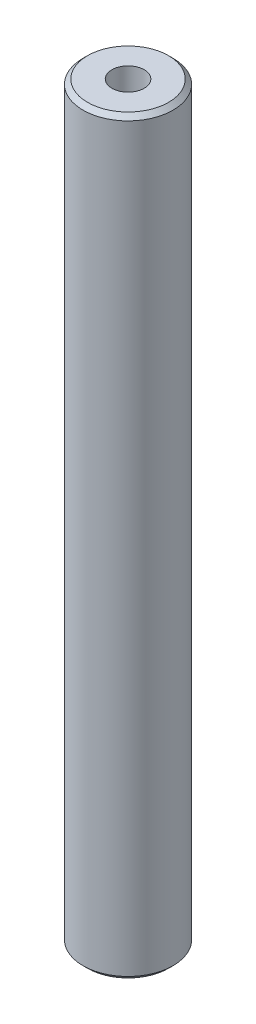
ISO-10303-21;
HEADER;
FILE_DESCRIPTION(('STEP AP214'),'2;1');
FILE_NAME('part.step','',(''),(''),'','','');
FILE_SCHEMA(('AUTOMOTIVE_DESIGN { 1 0 10303 214 1 1 1 1 }'));
ENDSEC;
DATA;
#1=APPLICATION_CONTEXT('core data for automotive mechanical design processes');
#2=APPLICATION_PROTOCOL_DEFINITION('international standard','automotive_design',2000,#1);
#3=PRODUCT_CONTEXT('',#1,'mechanical');
#4=PRODUCT('Part','Part','',(#3));
#5=PRODUCT_RELATED_PRODUCT_CATEGORY('part','',(#4));
#6=PRODUCT_DEFINITION_FORMATION('','',#4);
#7=PRODUCT_DEFINITION_CONTEXT('part definition',#1,'design');
#8=PRODUCT_DEFINITION('design','',#6,#7);
#9=PRODUCT_DEFINITION_SHAPE('','',#8);
#10=(LENGTH_UNIT() NAMED_UNIT(*) SI_UNIT(.MILLI.,.METRE.));
#11=(NAMED_UNIT(*) PLANE_ANGLE_UNIT() SI_UNIT($,.RADIAN.));
#12=(NAMED_UNIT(*) SI_UNIT($,.STERADIAN.) SOLID_ANGLE_UNIT());
#13=UNCERTAINTY_MEASURE_WITH_UNIT(LENGTH_MEASURE(1.E-05),#10,'distance_accuracy_value','');
#14=(GEOMETRIC_REPRESENTATION_CONTEXT(3) GLOBAL_UNCERTAINTY_ASSIGNED_CONTEXT((#13)) GLOBAL_UNIT_ASSIGNED_CONTEXT((#10,
#11,#12)) REPRESENTATION_CONTEXT('',''));
#15=CARTESIAN_POINT('',(0.,0.,0.));
#16=DIRECTION('',(0.,0.,1.));
#17=DIRECTION('',(1.,0.,0.));
#18=AXIS2_PLACEMENT_3D('',#15,#16,#17);
#19=CARTESIAN_POINT('',(0.,208.357307325694,0.));
#20=DIRECTION('',(0.,-1.,0.));
#21=DIRECTION('',(0.,0.,-1.));
#22=AXIS2_PLACEMENT_3D('',#19,#20,#21);
#23=CYLINDRICAL_SURFACE('',#22,12.5);
#24=CARTESIAN_POINT('',(0.,207.105443076522,0.));
#25=DIRECTION('',(0.,1.,0.));
#26=DIRECTION('',(0.,0.,1.));
#27=AXIS2_PLACEMENT_3D('',#24,#25,#26);
#28=CIRCLE('',#27,12.5);
#29=CARTESIAN_POINT('',(0.,207.105443076521,-12.5));
#30=VERTEX_POINT('',#29);
#31=EDGE_CURVE('E50',#30,#30,#28,.F.);
#32=CARTESIAN_POINT('',(0.,1.25186424917273,0.));
#33=DIRECTION('',(0.,1.,0.));
#34=DIRECTION('',(0.,0.,1.));
#35=AXIS2_PLACEMENT_3D('',#32,#33,#34);
#36=CIRCLE('',#35,12.5);
#37=CARTESIAN_POINT('',(0.,1.25186424917273,-12.5));
#38=VERTEX_POINT('',#37);
#39=EDGE_CURVE('E51',#38,#38,#36,.T.);
#40=CARTESIAN_POINT('',(0.,207.105443076521,-12.5));
#41=CARTESIAN_POINT('',(0.,204.961134963737,-12.5));
#42=CARTESIAN_POINT('',(0.,202.816826850952,-12.5));
#43=CARTESIAN_POINT('',(0.,198.528210625382,-12.5));
#44=CARTESIAN_POINT('',(0.,196.383902512597,-12.5));
#45=CARTESIAN_POINT('',(0.,192.095286287027,-12.5));
#46=CARTESIAN_POINT('',(0.,189.950978174242,-12.5));
#47=CARTESIAN_POINT('',(0.,185.662361948673,-12.5));
#48=CARTESIAN_POINT('',(0.,183.518053835888,-12.5));
#49=CARTESIAN_POINT('',(0.,179.229437610318,-12.5));
#50=CARTESIAN_POINT('',(0.,177.085129497533,-12.5));
#51=CARTESIAN_POINT('',(0.,172.796513271963,-12.5));
#52=CARTESIAN_POINT('',(0.,170.652205159178,-12.5));
#53=CARTESIAN_POINT('',(0.,166.363588933609,-12.5));
#54=CARTESIAN_POINT('',(0.,164.219280820824,-12.5));
#55=CARTESIAN_POINT('',(0.,159.930664595254,-12.5));
#56=CARTESIAN_POINT('',(0.,157.786356482469,-12.5));
#57=CARTESIAN_POINT('',(0.,153.497740256899,-12.5));
#58=CARTESIAN_POINT('',(0.,151.353432144115,-12.5));
#59=CARTESIAN_POINT('',(0.,147.064815918545,-12.5));
#60=CARTESIAN_POINT('',(0.,144.92050780576,-12.5));
#61=CARTESIAN_POINT('',(0.,140.63189158019,-12.5));
#62=CARTESIAN_POINT('',(0.,138.487583467405,-12.5));
#63=CARTESIAN_POINT('',(0.,134.198967241836,-12.5));
#64=CARTESIAN_POINT('',(0.,132.054659129051,-12.5));
#65=CARTESIAN_POINT('',(0.,127.766042903481,-12.5));
#66=CARTESIAN_POINT('',(0.,125.621734790696,-12.5));
#67=CARTESIAN_POINT('',(0.,121.333118565126,-12.5));
#68=CARTESIAN_POINT('',(0.,119.188810452341,-12.5));
#69=CARTESIAN_POINT('',(0.,114.900194226772,-12.5));
#70=CARTESIAN_POINT('',(0.,112.755886113987,-12.5));
#71=CARTESIAN_POINT('',(0.,108.467269888417,-12.5));
#72=CARTESIAN_POINT('',(0.,106.322961775632,-12.5));
#73=CARTESIAN_POINT('',(0.,102.034345550062,-12.5));
#74=CARTESIAN_POINT('',(0.,99.8900374372774,-12.5));
#75=CARTESIAN_POINT('',(0.,95.6014212117076,-12.5));
#76=CARTESIAN_POINT('',(0.,93.4571130989227,-12.5));
#77=CARTESIAN_POINT('',(0.,89.168496873353,-12.5));
#78=CARTESIAN_POINT('',(0.,87.0241887605681,-12.5));
#79=CARTESIAN_POINT('',(0.,82.7355725349983,-12.5));
#80=CARTESIAN_POINT('',(0.,80.5912644222134,-12.5));
#81=CARTESIAN_POINT('',(0.,76.3026481966436,-12.5));
#82=CARTESIAN_POINT('',(0.,74.1583400838588,-12.5));
#83=CARTESIAN_POINT('',(0.,69.869723858289,-12.5));
#84=CARTESIAN_POINT('',(0.,67.7254157455041,-12.5));
#85=CARTESIAN_POINT('',(0.,63.4367995199343,-12.5));
#86=CARTESIAN_POINT('',(0.,61.2924914071495,-12.5));
#87=CARTESIAN_POINT('',(0.,57.0038751815797,-12.5));
#88=CARTESIAN_POINT('',(0.,54.8595670687948,-12.5));
#89=CARTESIAN_POINT('',(0.,50.570950843225,-12.5));
#90=CARTESIAN_POINT('',(0.,48.4266427304402,-12.5));
#91=CARTESIAN_POINT('',(0.,44.1380265048704,-12.5));
#92=CARTESIAN_POINT('',(0.,41.9937183920855,-12.5));
#93=CARTESIAN_POINT('',(0.,37.7051021665157,-12.5));
#94=CARTESIAN_POINT('',(0.,35.5607940537309,-12.5));
#95=CARTESIAN_POINT('',(0.,31.2721778281611,-12.5));
#96=CARTESIAN_POINT('',(0.,29.1278697153762,-12.5));
#97=CARTESIAN_POINT('',(0.,24.8392534898064,-12.5));
#98=CARTESIAN_POINT('',(0.,22.6949453770216,-12.5));
#99=CARTESIAN_POINT('',(0.,18.4063291514518,-12.5));
#100=CARTESIAN_POINT('',(0.,16.2620210386669,-12.5));
#101=CARTESIAN_POINT('',(0.,11.9734048130972,-12.5));
#102=CARTESIAN_POINT('',(0.,9.82909670031227,-12.5));
#103=CARTESIAN_POINT('',(0.,5.5404804747425,-12.5));
#104=CARTESIAN_POINT('',(0.,3.39617236195761,-12.5));
#105=CARTESIAN_POINT('',(0.,1.25186424917273,-12.5));
#106=B_SPLINE_CURVE_WITH_KNOTS('',3,(#40,#41,#42,#43,#44,#45,#46,#47,#48,#49,#50,#51,#52,#53,
#54,#55,#56,#57,#58,#59,#60,#61,#62,#63,#64,#65,#66,#67,#68,#69,#70,#71,#72,#73,#74,#75,#76,#77,
#78,#79,#80,#81,#82,#83,#84,#85,#86,#87,#88,#89,#90,#91,#92,#93,#94,#95,#96,#97,#98,#99,#100,
#101,#102,#103,#104,#105),.UNSPECIFIED.,.F.,.F.,(4,2,2,2,2,2,2,2,2,2,2,2,2,2,2,2,2,2,2,2,2,2,2,
2,2,2,2,2,2,2,2,2,4),(0.,6.43292433835463,12.8658486767093,19.2987730150639,25.7316973534186,
32.1646216917732,38.5975460301279,45.0304703684825,51.4633947068372,57.8963190451918,
64.3292433835465,70.7621677219011,77.1950920602558,83.6280163986104,90.0609407369651,
96.4938650753197,102.926789413674,109.359713752029,115.792638090384,122.225562428738,
128.658486767093,135.091411105448,141.524335443802,147.957259782157,154.390184120512,
160.823108458866,167.256032797221,173.688957135575,180.12188147393,186.554805812285,
192.987730150639,199.420654488994,205.853578827349),.UNSPECIFIED.);
#107=EDGE_CURVE('BSEAM39',#30,#38,#106,.T.);
#108=ORIENTED_EDGE('',*,*,#31,.T.);
#109=ORIENTED_EDGE('',*,*,#39,.T.);
#110=ORIENTED_EDGE('',*,*,#107,.T.);
#111=ORIENTED_EDGE('',*,*,#107,.F.);
#112=EDGE_LOOP('',(#108,#110,#109,#111));
#113=FACE_BOUND('',#112,.T.);
#114=ADVANCED_FACE('F39',(#113),#23,.T.);
#115=CARTESIAN_POINT('',(0.,208.357307325694,0.));
#116=DIRECTION('',(0.,1.,0.));
#117=DIRECTION('',(0.,0.,1.));
#118=AXIS2_PLACEMENT_3D('',#115,#116,#117);
#119=PLANE('',#118);
#120=CARTESIAN_POINT('',(0.,208.357307325694,0.));
#121=DIRECTION('',(0.,1.,0.));
#122=DIRECTION('',(0.,0.,1.));
#123=AXIS2_PLACEMENT_3D('',#120,#121,#122);
#124=CIRCLE('',#123,11.2481357508276);
#125=CARTESIAN_POINT('',(0.,208.357307325694,11.2481357508276));
#126=VERTEX_POINT('',#125);
#127=EDGE_CURVE('E54',#126,#126,#124,.T.);
#128=ORIENTED_EDGE('',*,*,#127,.T.);
#129=EDGE_LOOP('',(#128));
#130=FACE_BOUND('',#129,.T.);
#131=CARTESIAN_POINT('',(0.,208.357307325694,0.));
#132=DIRECTION('',(0.,1.,0.));
#133=DIRECTION('',(0.,0.,1.));
#134=AXIS2_PLACEMENT_3D('',#131,#132,#133);
#135=CIRCLE('',#134,4.47973065816393);
#136=CARTESIAN_POINT('',(0.,208.357307325694,-4.47973065816393));
#137=VERTEX_POINT('',#136);
#138=EDGE_CURVE('E58',#137,#137,#135,.T.);
#139=ORIENTED_EDGE('',*,*,#138,.F.);
#140=EDGE_LOOP('',(#139));
#141=FACE_BOUND('',#140,.T.);
#142=ADVANCED_FACE('F69',(#130,#141),#119,.T.);
#143=CARTESIAN_POINT('',(0.,0.,0.));
#144=DIRECTION('',(0.,1.,0.));
#145=DIRECTION('',(0.,0.,1.));
#146=AXIS2_PLACEMENT_3D('',#143,#144,#145);
#147=PLANE('',#146);
#148=CARTESIAN_POINT('',(0.,0.,0.));
#149=DIRECTION('',(0.,1.,0.));
#150=DIRECTION('',(0.,0.,1.));
#151=AXIS2_PLACEMENT_3D('',#148,#149,#150);
#152=CIRCLE('',#151,11.2481357508273);
#153=CARTESIAN_POINT('',(0.,0.,11.2481357508273));
#154=VERTEX_POINT('',#153);
#155=EDGE_CURVE('E10',#154,#154,#152,.F.);
#156=ORIENTED_EDGE('',*,*,#155,.T.);
#157=EDGE_LOOP('',(#156));
#158=FACE_BOUND('',#157,.T.);
#159=CARTESIAN_POINT('',(0.,0.,0.));
#160=DIRECTION('',(0.,1.,0.));
#161=DIRECTION('',(0.,0.,1.));
#162=AXIS2_PLACEMENT_3D('',#159,#160,#161);
#163=CIRCLE('',#162,4.47973065816393);
#164=CARTESIAN_POINT('',(0.,0.,-4.47973065816393));
#165=VERTEX_POINT('',#164);
#166=EDGE_CURVE('E63',#165,#165,#163,.T.);
#167=ORIENTED_EDGE('',*,*,#166,.T.);
#168=EDGE_LOOP('',(#167));
#169=FACE_BOUND('',#168,.T.);
#170=ADVANCED_FACE('F75',(#158,#169),#147,.F.);
#171=CARTESIAN_POINT('',(0.,208.357307325694,0.));
#172=DIRECTION('',(0.,-1.,0.));
#173=DIRECTION('',(0.,0.,-1.));
#174=AXIS2_PLACEMENT_3D('',#171,#172,#173);
#175=CYLINDRICAL_SURFACE('',#174,4.47973065816393);
#176=CARTESIAN_POINT('',(0.,208.357307325694,-4.47973065816393));
#177=CARTESIAN_POINT('',(0.,206.186918707718,-4.47973065816393));
#178=CARTESIAN_POINT('',(0.,204.016530089742,-4.47973065816393));
#179=CARTESIAN_POINT('',(0.,199.67575285379,-4.47973065816393));
#180=CARTESIAN_POINT('',(0.,197.505364235814,-4.47973065816393));
#181=CARTESIAN_POINT('',(0.,193.164586999862,-4.47973065816393));
#182=CARTESIAN_POINT('',(0.,190.994198381886,-4.47973065816393));
#183=CARTESIAN_POINT('',(0.,186.653421145934,-4.47973065816393));
#184=CARTESIAN_POINT('',(0.,184.483032527958,-4.47973065816393));
#185=CARTESIAN_POINT('',(0.,180.142255292006,-4.47973065816393));
#186=CARTESIAN_POINT('',(0.,177.97186667403,-4.47973065816393));
#187=CARTESIAN_POINT('',(0.,173.631089438078,-4.47973065816393));
#188=CARTESIAN_POINT('',(0.,171.460700820102,-4.47973065816393));
#189=CARTESIAN_POINT('',(0.,167.11992358415,-4.47973065816393));
#190=CARTESIAN_POINT('',(0.,164.949534966174,-4.47973065816393));
#191=CARTESIAN_POINT('',(0.,160.608757730222,-4.47973065816393));
#192=CARTESIAN_POINT('',(0.,158.438369112246,-4.47973065816393));
#193=CARTESIAN_POINT('',(0.,154.097591876294,-4.47973065816393));
#194=CARTESIAN_POINT('',(0.,151.927203258318,-4.47973065816393));
#195=CARTESIAN_POINT('',(0.,147.586426022366,-4.47973065816393));
#196=CARTESIAN_POINT('',(0.,145.416037404391,-4.47973065816393));
#197=CARTESIAN_POINT('',(0.,141.075260168439,-4.47973065816393));
#198=CARTESIAN_POINT('',(0.,138.904871550463,-4.47973065816393));
#199=CARTESIAN_POINT('',(0.,134.564094314511,-4.47973065816393));
#200=CARTESIAN_POINT('',(0.,132.393705696535,-4.47973065816393));
#201=CARTESIAN_POINT('',(0.,128.052928460583,-4.47973065816393));
#202=CARTESIAN_POINT('',(0.,125.882539842607,-4.47973065816393));
#203=CARTESIAN_POINT('',(0.,121.541762606655,-4.47973065816393));
#204=CARTESIAN_POINT('',(0.,119.371373988679,-4.47973065816393));
#205=CARTESIAN_POINT('',(0.,115.030596752727,-4.47973065816393));
#206=CARTESIAN_POINT('',(0.,112.860208134751,-4.47973065816393));
#207=CARTESIAN_POINT('',(0.,108.519430898799,-4.47973065816393));
#208=CARTESIAN_POINT('',(0.,106.349042280823,-4.47973065816393));
#209=CARTESIAN_POINT('',(0.,102.008265044871,-4.47973065816393));
#210=CARTESIAN_POINT('',(0.,99.837876426895,-4.47973065816393));
#211=CARTESIAN_POINT('',(0.,95.497099190943,-4.47973065816393));
#212=CARTESIAN_POINT('',(0.,93.326710572967,-4.47973065816393));
#213=CARTESIAN_POINT('',(0.,88.9859333370151,-4.47973065816393));
#214=CARTESIAN_POINT('',(0.,86.8155447190391,-4.47973065816393));
#215=CARTESIAN_POINT('',(0.,82.4747674830872,-4.47973065816393));
#216=CARTESIAN_POINT('',(0.,80.3043788651112,-4.47973065816393));
#217=CARTESIAN_POINT('',(0.,75.9636016291592,-4.47973065816393));
#218=CARTESIAN_POINT('',(0.,73.7932130111833,-4.47973065816393));
#219=CARTESIAN_POINT('',(0.,69.4524357752313,-4.47973065816393));
#220=CARTESIAN_POINT('',(0.,67.2820471572553,-4.47973065816393));
#221=CARTESIAN_POINT('',(0.,62.9412699213034,-4.47973065816393));
#222=CARTESIAN_POINT('',(0.,60.7708813033274,-4.47973065816393));
#223=CARTESIAN_POINT('',(0.,56.4301040673754,-4.47973065816393));
#224=CARTESIAN_POINT('',(0.,54.2597154493995,-4.47973065816393));
#225=CARTESIAN_POINT('',(0.,49.9189382134475,-4.47973065816393));
#226=CARTESIAN_POINT('',(0.,47.7485495954715,-4.47973065816393));
#227=CARTESIAN_POINT('',(0.,43.4077723595196,-4.47973065816393));
#228=CARTESIAN_POINT('',(0.,41.2373837415436,-4.47973065816393));
#229=CARTESIAN_POINT('',(0.,36.8966065055916,-4.47973065816393));
#230=CARTESIAN_POINT('',(0.,34.7262178876157,-4.47973065816393));
#231=CARTESIAN_POINT('',(0.,30.3854406516637,-4.47973065816393));
#232=CARTESIAN_POINT('',(0.,28.2150520336877,-4.47973065816393));
#233=CARTESIAN_POINT('',(0.,23.8742747977358,-4.47973065816393));
#234=CARTESIAN_POINT('',(0.,21.7038861797598,-4.47973065816393));
#235=CARTESIAN_POINT('',(0.,17.3631089438078,-4.47973065816393));
#236=CARTESIAN_POINT('',(0.,15.1927203258319,-4.47973065816393));
#237=CARTESIAN_POINT('',(0.,10.8519430898799,-4.47973065816393));
#238=CARTESIAN_POINT('',(0.,8.68155447190392,-4.47973065816393));
#239=CARTESIAN_POINT('',(0.,4.34077723595196,-4.47973065816393));
#240=CARTESIAN_POINT('',(0.,2.17038861797598,-4.47973065816393));
#241=CARTESIAN_POINT('',(0.,0.,-4.47973065816393));
#242=B_SPLINE_CURVE_WITH_KNOTS('',3,(#176,#177,#178,#179,#180,#181,#182,#183,#184,#185,#186,
#187,#188,#189,#190,#191,#192,#193,#194,#195,#196,#197,#198,#199,#200,#201,#202,#203,#204,#205,
#206,#207,#208,#209,#210,#211,#212,#213,#214,#215,#216,#217,#218,#219,#220,#221,#222,#223,#224,
#225,#226,#227,#228,#229,#230,#231,#232,#233,#234,#235,#236,#237,#238,#239,#240,#241),
.UNSPECIFIED.,.F.,.F.,(4,2,2,2,2,2,2,2,2,2,2,2,2,2,2,2,2,2,2,2,2,2,2,2,2,2,2,2,2,2,2,2,4),(0.,
6.51116585392794,13.0223317078559,19.5334975617838,26.0446634157117,32.5558292696397,
39.0669951235676,45.5781609774955,52.0893268314235,58.6004926853514,65.1116585392793,
71.6228243932073,78.1339902471352,84.6451561010632,91.1563219549911,97.667487808919,
104.178653662847,110.689819516775,117.200985370703,123.712151224631,130.223317078559,
136.734482932487,143.245648786415,149.756814640342,156.26798049427,162.779146348198,
169.290312202126,175.801478056054,182.312643909982,188.82380976391,195.334975617838,
201.846141471766,208.357307325694),.UNSPECIFIED.);
#243=EDGE_CURVE('BSEAM70',#137,#165,#242,.T.);
#244=ORIENTED_EDGE('',*,*,#138,.T.);
#245=ORIENTED_EDGE('',*,*,#166,.F.);
#246=ORIENTED_EDGE('',*,*,#243,.T.);
#247=ORIENTED_EDGE('',*,*,#243,.F.);
#248=EDGE_LOOP('',(#244,#246,#245,#247));
#249=FACE_BOUND('',#248,.T.);
#250=ADVANCED_FACE('F70',(#249),#175,.F.);
#251=CARTESIAN_POINT('',(0.,208.357307325694,0.));
#252=DIRECTION('',(0.,-1.,0.));
#253=DIRECTION('',(0.,0.,-1.));
#254=AXIS2_PLACEMENT_3D('',#251,#252,#253);
#255=CONICAL_SURFACE('',#254,11.2481357508276,0.785398163397446);
#256=ORIENTED_EDGE('',*,*,#31,.F.);
#257=EDGE_LOOP('',(#256));
#258=FACE_BOUND('',#257,.T.);
#259=ORIENTED_EDGE('',*,*,#127,.F.);
#260=EDGE_LOOP('',(#259));
#261=FACE_BOUND('',#260,.T.);
#262=ADVANCED_FACE('F81',(#258,#261),#255,.T.);
#263=CARTESIAN_POINT('',(0.,1.25186424917273,0.));
#264=DIRECTION('',(0.,1.,0.));
#265=DIRECTION('',(0.,0.,1.));
#266=AXIS2_PLACEMENT_3D('',#263,#264,#265);
#267=CONICAL_SURFACE('',#266,12.5,0.785398163397445);
#268=ORIENTED_EDGE('',*,*,#155,.F.);
#269=EDGE_LOOP('',(#268));
#270=FACE_BOUND('',#269,.T.);
#271=ORIENTED_EDGE('',*,*,#39,.F.);
#272=EDGE_LOOP('',(#271));
#273=FACE_BOUND('',#272,.T.);
#274=ADVANCED_FACE('F45',(#270,#273),#267,.T.);
#275=CLOSED_SHELL('',(#114,#142,#170,#250,#262,#274));
#276=MANIFOLD_SOLID_BREP('B2',#275);
#277=ADVANCED_BREP_SHAPE_REPRESENTATION('',(#18,#276),#14);
#278=SHAPE_DEFINITION_REPRESENTATION(#9,#277);
ENDSEC;
END-ISO-10303-21;
